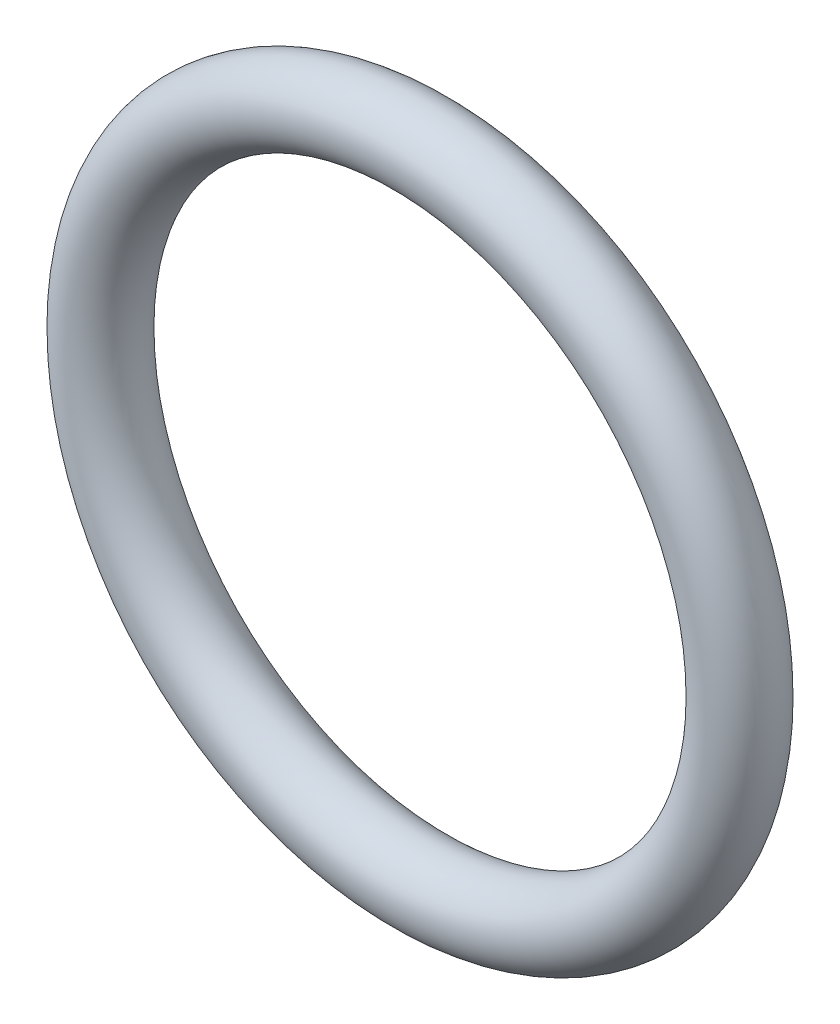
ISO-10303-21;
HEADER;
FILE_DESCRIPTION(('STEP AP214'),'2;1');
FILE_NAME('part.step','',(''),(''),'','','');
FILE_SCHEMA(('AUTOMOTIVE_DESIGN { 1 0 10303 214 1 1 1 1 }'));
ENDSEC;
DATA;
#1=APPLICATION_CONTEXT('core data for automotive mechanical design processes');
#2=APPLICATION_PROTOCOL_DEFINITION('international standard','automotive_design',2000,#1);
#3=PRODUCT_CONTEXT('',#1,'mechanical');
#4=PRODUCT('Part','Part','',(#3));
#5=PRODUCT_RELATED_PRODUCT_CATEGORY('part','',(#4));
#6=PRODUCT_DEFINITION_FORMATION('','',#4);
#7=PRODUCT_DEFINITION_CONTEXT('part definition',#1,'design');
#8=PRODUCT_DEFINITION('design','',#6,#7);
#9=PRODUCT_DEFINITION_SHAPE('','',#8);
#10=(LENGTH_UNIT() NAMED_UNIT(*) SI_UNIT(.MILLI.,.METRE.));
#11=(NAMED_UNIT(*) PLANE_ANGLE_UNIT() SI_UNIT($,.RADIAN.));
#12=(NAMED_UNIT(*) SI_UNIT($,.STERADIAN.) SOLID_ANGLE_UNIT());
#13=UNCERTAINTY_MEASURE_WITH_UNIT(LENGTH_MEASURE(1.E-05),#10,'distance_accuracy_value','');
#14=(GEOMETRIC_REPRESENTATION_CONTEXT(3) GLOBAL_UNCERTAINTY_ASSIGNED_CONTEXT((#13)) GLOBAL_UNIT_ASSIGNED_CONTEXT((#10,
#11,#12)) REPRESENTATION_CONTEXT('',''));
#15=CARTESIAN_POINT('',(0.,0.,0.));
#16=DIRECTION('',(0.,0.,1.));
#17=DIRECTION('',(1.,0.,0.));
#18=AXIS2_PLACEMENT_3D('',#15,#16,#17);
#19=CARTESIAN_POINT('',(0.,0.,0.));
#20=DIRECTION('',(0.,0.,-1.));
#21=DIRECTION('',(-1.,0.,0.));
#22=AXIS2_PLACEMENT_3D('',#19,#20,#21);
#23=TOROIDAL_SURFACE('',#22,7.6,0.9);
#24=CARTESIAN_POINT('',(-8.5,0.,0.));
#25=VERTEX_POINT('',#24);
#26=VERTEX_LOOP('',#25);
#27=FACE_BOUND('',#26,.T.);
#28=ADVANCED_FACE('F28',(#27),#23,.T.);
#29=CLOSED_SHELL('',(#28));
#30=MANIFOLD_SOLID_BREP('B2',#29);
#31=ADVANCED_BREP_SHAPE_REPRESENTATION('',(#18,#30),#14);
#32=SHAPE_DEFINITION_REPRESENTATION(#9,#31);
ENDSEC;
END-ISO-10303-21;
